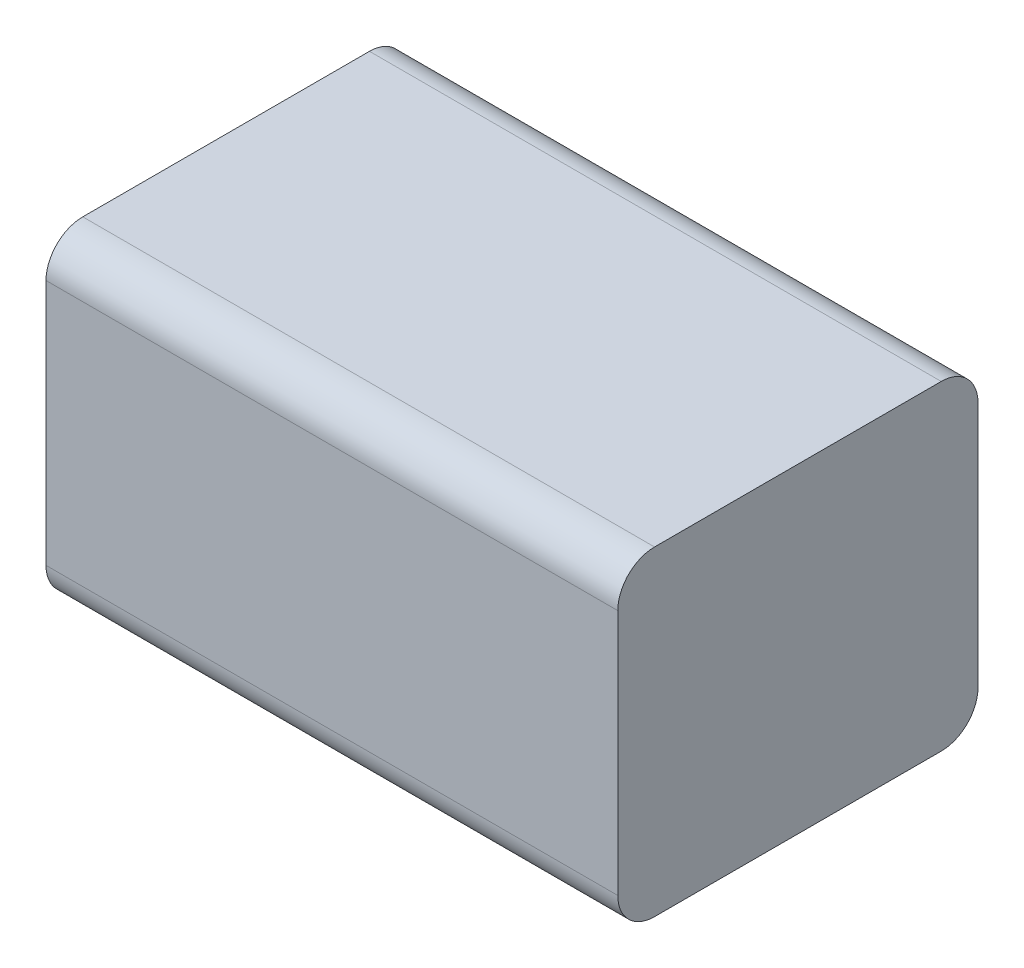
ISO-10303-21;
HEADER;
FILE_DESCRIPTION(('STEP AP214'),'2;1');
FILE_NAME('part.step','',(''),(''),'','','');
FILE_SCHEMA(('AUTOMOTIVE_DESIGN { 1 0 10303 214 1 1 1 1 }'));
ENDSEC;
DATA;
#1=APPLICATION_CONTEXT('core data for automotive mechanical design processes');
#2=APPLICATION_PROTOCOL_DEFINITION('international standard','automotive_design',2000,#1);
#3=PRODUCT_CONTEXT('',#1,'mechanical');
#4=PRODUCT('Part','Part','',(#3));
#5=PRODUCT_RELATED_PRODUCT_CATEGORY('part','',(#4));
#6=PRODUCT_DEFINITION_FORMATION('','',#4);
#7=PRODUCT_DEFINITION_CONTEXT('part definition',#1,'design');
#8=PRODUCT_DEFINITION('design','',#6,#7);
#9=PRODUCT_DEFINITION_SHAPE('','',#8);
#10=(LENGTH_UNIT() NAMED_UNIT(*) SI_UNIT(.MILLI.,.METRE.));
#11=(NAMED_UNIT(*) PLANE_ANGLE_UNIT() SI_UNIT($,.RADIAN.));
#12=(NAMED_UNIT(*) SI_UNIT($,.STERADIAN.) SOLID_ANGLE_UNIT());
#13=UNCERTAINTY_MEASURE_WITH_UNIT(LENGTH_MEASURE(1.E-05),#10,'distance_accuracy_value','');
#14=(GEOMETRIC_REPRESENTATION_CONTEXT(3) GLOBAL_UNCERTAINTY_ASSIGNED_CONTEXT((#13)) GLOBAL_UNIT_ASSIGNED_CONTEXT((#10,
#11,#12)) REPRESENTATION_CONTEXT('',''));
#15=CARTESIAN_POINT('',(0.,0.,0.));
#16=DIRECTION('',(0.,0.,1.));
#17=DIRECTION('',(1.,0.,0.));
#18=AXIS2_PLACEMENT_3D('',#15,#16,#17);
#19=CARTESIAN_POINT('',(-1.4,-0.784,0.018));
#20=DIRECTION('',(1.,0.,0.));
#21=DIRECTION('',(0.,0.,1.));
#22=AXIS2_PLACEMENT_3D('',#19,#20,#21);
#23=PLANE('',#22);
#24=CARTESIAN_POINT('',(-1.4,-0.604,1.602));
#25=DIRECTION('',(-1.,0.,0.));
#26=DIRECTION('',(0.,-1.,0.));
#27=AXIS2_PLACEMENT_3D('',#24,#25,#26);
#28=CIRCLE('',#27,0.18);
#29=CARTESIAN_POINT('',(-1.4,-0.784,1.602));
#30=VERTEX_POINT('',#29);
#31=CARTESIAN_POINT('',(-1.4,-0.604,1.782));
#32=VERTEX_POINT('',#31);
#33=EDGE_CURVE('E11',#30,#32,#28,.T.);
#34=ORIENTED_EDGE('',*,*,#33,.T.);
#35=DIRECTION('',(0.,1.,0.));
#36=VECTOR('',#35,1.);
#37=CARTESIAN_POINT('',(-1.4,-0.604,1.782));
#38=LINE('',#37,#36);
#39=CARTESIAN_POINT('',(-1.4,0.604,1.782));
#40=VERTEX_POINT('',#39);
#41=EDGE_CURVE('E142',#32,#40,#38,.T.);
#42=ORIENTED_EDGE('',*,*,#41,.T.);
#43=CARTESIAN_POINT('',(-1.4,0.604,1.602));
#44=DIRECTION('',(1.,0.,0.));
#45=DIRECTION('',(0.,1.,0.));
#46=AXIS2_PLACEMENT_3D('',#43,#44,#45);
#47=CIRCLE('',#46,0.18);
#48=CARTESIAN_POINT('',(-1.4,0.784,1.602));
#49=VERTEX_POINT('',#48);
#50=EDGE_CURVE('E136',#49,#40,#47,.T.);
#51=ORIENTED_EDGE('',*,*,#50,.F.);
#52=DIRECTION('',(0.,0.,1.));
#53=VECTOR('',#52,1.);
#54=CARTESIAN_POINT('',(-1.4,0.784,0.198));
#55=LINE('',#54,#53);
#56=CARTESIAN_POINT('',(-1.4,0.784,0.198));
#57=VERTEX_POINT('',#56);
#58=EDGE_CURVE('E97',#57,#49,#55,.T.);
#59=ORIENTED_EDGE('',*,*,#58,.F.);
#60=CARTESIAN_POINT('',(-1.4,0.604,0.198));
#61=DIRECTION('',(-1.,0.,0.));
#62=DIRECTION('',(0.,1.,0.));
#63=AXIS2_PLACEMENT_3D('',#60,#61,#62);
#64=CIRCLE('',#63,0.18);
#65=CARTESIAN_POINT('',(-1.4,0.604,0.018));
#66=VERTEX_POINT('',#65);
#67=EDGE_CURVE('E120',#57,#66,#64,.T.);
#68=ORIENTED_EDGE('',*,*,#67,.T.);
#69=DIRECTION('',(0.,1.,0.));
#70=VECTOR('',#69,1.);
#71=CARTESIAN_POINT('',(-1.4,-0.604,0.018));
#72=LINE('',#71,#70);
#73=CARTESIAN_POINT('',(-1.4,-0.604,0.018));
#74=VERTEX_POINT('',#73);
#75=EDGE_CURVE('E112',#74,#66,#72,.T.);
#76=ORIENTED_EDGE('',*,*,#75,.F.);
#77=CARTESIAN_POINT('',(-1.4,-0.604,0.198));
#78=DIRECTION('',(1.,0.,0.));
#79=DIRECTION('',(0.,-1.,0.));
#80=AXIS2_PLACEMENT_3D('',#77,#78,#79);
#81=CIRCLE('',#80,0.18);
#82=CARTESIAN_POINT('',(-1.4,-0.784,0.198));
#83=VERTEX_POINT('',#82);
#84=EDGE_CURVE('E140',#83,#74,#81,.T.);
#85=ORIENTED_EDGE('',*,*,#84,.F.);
#86=DIRECTION('',(0.,0.,1.));
#87=VECTOR('',#86,1.);
#88=CARTESIAN_POINT('',(-1.4,-0.784,0.198));
#89=LINE('',#88,#87);
#90=EDGE_CURVE('E138',#83,#30,#89,.T.);
#91=ORIENTED_EDGE('',*,*,#90,.T.);
#92=EDGE_LOOP('',(#34,#42,#51,#59,#68,#76,#85,#91));
#93=FACE_BOUND('',#92,.T.);
#94=ADVANCED_FACE('F17',(#93),#23,.F.);
#95=CARTESIAN_POINT('',(-1.4,-0.784,0.018));
#96=DIRECTION('',(0.,1.,0.));
#97=DIRECTION('',(0.,0.,1.));
#98=AXIS2_PLACEMENT_3D('',#95,#96,#97);
#99=PLANE('',#98);
#100=DIRECTION('',(1.,0.,0.));
#101=VECTOR('',#100,1.);
#102=CARTESIAN_POINT('',(-1.4,-0.784,1.602));
#103=LINE('',#102,#101);
#104=CARTESIAN_POINT('',(1.4,-0.784,1.602));
#105=VERTEX_POINT('',#104);
#106=EDGE_CURVE('E24',#30,#105,#103,.T.);
#107=ORIENTED_EDGE('',*,*,#106,.F.);
#108=ORIENTED_EDGE('',*,*,#90,.F.);
#109=DIRECTION('',(1.,0.,0.));
#110=VECTOR('',#109,1.);
#111=CARTESIAN_POINT('',(-1.4,-0.784,0.198));
#112=LINE('',#111,#110);
#113=CARTESIAN_POINT('',(1.4,-0.784,0.198));
#114=VERTEX_POINT('',#113);
#115=EDGE_CURVE('E132',#83,#114,#112,.T.);
#116=ORIENTED_EDGE('',*,*,#115,.T.);
#117=DIRECTION('',(0.,0.,1.));
#118=VECTOR('',#117,1.);
#119=CARTESIAN_POINT('',(1.4,-0.784,0.198));
#120=LINE('',#119,#118);
#121=EDGE_CURVE('E122',#114,#105,#120,.T.);
#122=ORIENTED_EDGE('',*,*,#121,.T.);
#123=EDGE_LOOP('',(#107,#108,#116,#122));
#124=FACE_BOUND('',#123,.T.);
#125=ADVANCED_FACE('F147',(#124),#99,.F.);
#126=CARTESIAN_POINT('',(-1.4,-0.604,0.198));
#127=DIRECTION('',(1.,0.,0.));
#128=DIRECTION('',(0.,-1.,0.));
#129=AXIS2_PLACEMENT_3D('',#126,#127,#128);
#130=CYLINDRICAL_SURFACE('',#129,0.18);
#131=ORIENTED_EDGE('',*,*,#84,.T.);
#132=DIRECTION('',(1.,0.,0.));
#133=VECTOR('',#132,1.);
#134=CARTESIAN_POINT('',(-1.4,-0.604,0.018));
#135=LINE('',#134,#133);
#136=CARTESIAN_POINT('',(1.4,-0.604,0.018));
#137=VERTEX_POINT('',#136);
#138=EDGE_CURVE('E134',#74,#137,#135,.T.);
#139=ORIENTED_EDGE('',*,*,#138,.T.);
#140=CARTESIAN_POINT('',(1.4,-0.604,0.198));
#141=DIRECTION('',(1.,0.,0.));
#142=DIRECTION('',(0.,-1.,0.));
#143=AXIS2_PLACEMENT_3D('',#140,#141,#142);
#144=CIRCLE('',#143,0.18);
#145=EDGE_CURVE('E124',#114,#137,#144,.T.);
#146=ORIENTED_EDGE('',*,*,#145,.F.);
#147=ORIENTED_EDGE('',*,*,#115,.F.);
#148=EDGE_LOOP('',(#131,#139,#146,#147));
#149=FACE_BOUND('',#148,.T.);
#150=ADVANCED_FACE('F163',(#149),#130,.T.);
#151=CARTESIAN_POINT('',(-1.4,-0.604,1.602));
#152=DIRECTION('',(1.,0.,0.));
#153=DIRECTION('',(0.,-1.,0.));
#154=AXIS2_PLACEMENT_3D('',#151,#152,#153);
#155=CYLINDRICAL_SURFACE('',#154,0.18);
#156=ORIENTED_EDGE('',*,*,#106,.T.);
#157=CARTESIAN_POINT('',(1.4,-0.604,1.602));
#158=DIRECTION('',(-1.,0.,0.));
#159=DIRECTION('',(0.,-1.,0.));
#160=AXIS2_PLACEMENT_3D('',#157,#158,#159);
#161=CIRCLE('',#160,0.18);
#162=CARTESIAN_POINT('',(1.4,-0.604,1.782));
#163=VERTEX_POINT('',#162);
#164=EDGE_CURVE('E127',#105,#163,#161,.T.);
#165=ORIENTED_EDGE('',*,*,#164,.T.);
#166=DIRECTION('',(1.,0.,0.));
#167=VECTOR('',#166,1.);
#168=CARTESIAN_POINT('',(-1.4,-0.604,1.782));
#169=LINE('',#168,#167);
#170=EDGE_CURVE('E115',#32,#163,#169,.T.);
#171=ORIENTED_EDGE('',*,*,#170,.F.);
#172=ORIENTED_EDGE('',*,*,#33,.F.);
#173=EDGE_LOOP('',(#156,#165,#171,#172));
#174=FACE_BOUND('',#173,.T.);
#175=ADVANCED_FACE('F144',(#174),#155,.T.);
#176=CARTESIAN_POINT('',(-1.4,-0.784,0.018));
#177=DIRECTION('',(0.,0.,1.));
#178=DIRECTION('',(1.,0.,0.));
#179=AXIS2_PLACEMENT_3D('',#176,#177,#178);
#180=PLANE('',#179);
#181=DIRECTION('',(1.,0.,0.));
#182=VECTOR('',#181,1.);
#183=CARTESIAN_POINT('',(-1.4,0.604,0.018));
#184=LINE('',#183,#182);
#185=CARTESIAN_POINT('',(1.4,0.604,0.018));
#186=VERTEX_POINT('',#185);
#187=EDGE_CURVE('E129',#66,#186,#184,.T.);
#188=ORIENTED_EDGE('',*,*,#187,.T.);
#189=DIRECTION('',(0.,1.,0.));
#190=VECTOR('',#189,1.);
#191=CARTESIAN_POINT('',(1.4,-0.604,0.018));
#192=LINE('',#191,#190);
#193=EDGE_CURVE('E118',#137,#186,#192,.T.);
#194=ORIENTED_EDGE('',*,*,#193,.F.);
#195=ORIENTED_EDGE('',*,*,#138,.F.);
#196=ORIENTED_EDGE('',*,*,#75,.T.);
#197=EDGE_LOOP('',(#188,#194,#195,#196));
#198=FACE_BOUND('',#197,.T.);
#199=ADVANCED_FACE('F159',(#198),#180,.F.);
#200=CARTESIAN_POINT('',(-1.4,-0.784,1.782));
#201=DIRECTION('',(0.,0.,1.));
#202=DIRECTION('',(1.,0.,0.));
#203=AXIS2_PLACEMENT_3D('',#200,#201,#202);
#204=PLANE('',#203);
#205=ORIENTED_EDGE('',*,*,#41,.F.);
#206=ORIENTED_EDGE('',*,*,#170,.T.);
#207=DIRECTION('',(0.,1.,0.));
#208=VECTOR('',#207,1.);
#209=CARTESIAN_POINT('',(1.4,-0.604,1.782));
#210=LINE('',#209,#208);
#211=CARTESIAN_POINT('',(1.4,0.604,1.782));
#212=VERTEX_POINT('',#211);
#213=EDGE_CURVE('E104',#163,#212,#210,.T.);
#214=ORIENTED_EDGE('',*,*,#213,.T.);
#215=DIRECTION('',(1.,0.,0.));
#216=VECTOR('',#215,1.);
#217=CARTESIAN_POINT('',(-1.4,0.604,1.782));
#218=LINE('',#217,#216);
#219=EDGE_CURVE('E85',#40,#212,#218,.T.);
#220=ORIENTED_EDGE('',*,*,#219,.F.);
#221=EDGE_LOOP('',(#205,#206,#214,#220));
#222=FACE_BOUND('',#221,.T.);
#223=ADVANCED_FACE('F151',(#222),#204,.T.);
#224=CARTESIAN_POINT('',(-1.4,0.604,0.198));
#225=DIRECTION('',(1.,0.,0.));
#226=DIRECTION('',(0.,1.,0.));
#227=AXIS2_PLACEMENT_3D('',#224,#225,#226);
#228=CYLINDRICAL_SURFACE('',#227,0.18);
#229=DIRECTION('',(1.,0.,0.));
#230=VECTOR('',#229,1.);
#231=CARTESIAN_POINT('',(-1.4,0.784,0.198));
#232=LINE('',#231,#230);
#233=CARTESIAN_POINT('',(1.4,0.784,0.198));
#234=VERTEX_POINT('',#233);
#235=EDGE_CURVE('E110',#57,#234,#232,.T.);
#236=ORIENTED_EDGE('',*,*,#235,.T.);
#237=CARTESIAN_POINT('',(1.4,0.604,0.198));
#238=DIRECTION('',(-1.,0.,0.));
#239=DIRECTION('',(0.,1.,0.));
#240=AXIS2_PLACEMENT_3D('',#237,#238,#239);
#241=CIRCLE('',#240,0.18);
#242=EDGE_CURVE('E103',#234,#186,#241,.T.);
#243=ORIENTED_EDGE('',*,*,#242,.T.);
#244=ORIENTED_EDGE('',*,*,#187,.F.);
#245=ORIENTED_EDGE('',*,*,#67,.F.);
#246=EDGE_LOOP('',(#236,#243,#244,#245));
#247=FACE_BOUND('',#246,.T.);
#248=ADVANCED_FACE('F156',(#247),#228,.T.);
#249=CARTESIAN_POINT('',(-1.4,0.604,1.602));
#250=DIRECTION('',(1.,0.,0.));
#251=DIRECTION('',(0.,1.,0.));
#252=AXIS2_PLACEMENT_3D('',#249,#250,#251);
#253=CYLINDRICAL_SURFACE('',#252,0.18);
#254=ORIENTED_EDGE('',*,*,#50,.T.);
#255=ORIENTED_EDGE('',*,*,#219,.T.);
#256=CARTESIAN_POINT('',(1.4,0.604,1.602));
#257=DIRECTION('',(1.,0.,0.));
#258=DIRECTION('',(0.,1.,0.));
#259=AXIS2_PLACEMENT_3D('',#256,#257,#258);
#260=CIRCLE('',#259,0.18);
#261=CARTESIAN_POINT('',(1.4,0.784,1.602));
#262=VERTEX_POINT('',#261);
#263=EDGE_CURVE('E79',#262,#212,#260,.T.);
#264=ORIENTED_EDGE('',*,*,#263,.F.);
#265=DIRECTION('',(1.,0.,0.));
#266=VECTOR('',#265,1.);
#267=CARTESIAN_POINT('',(-1.4,0.784,1.602));
#268=LINE('',#267,#266);
#269=EDGE_CURVE('E83',#49,#262,#268,.T.);
#270=ORIENTED_EDGE('',*,*,#269,.F.);
#271=EDGE_LOOP('',(#254,#255,#264,#270));
#272=FACE_BOUND('',#271,.T.);
#273=ADVANCED_FACE('F82',(#272),#253,.T.);
#274=CARTESIAN_POINT('',(-1.4,0.784,0.018));
#275=DIRECTION('',(0.,1.,0.));
#276=DIRECTION('',(0.,0.,1.));
#277=AXIS2_PLACEMENT_3D('',#274,#275,#276);
#278=PLANE('',#277);
#279=DIRECTION('',(0.,0.,1.));
#280=VECTOR('',#279,1.);
#281=CARTESIAN_POINT('',(1.4,0.784,0.198));
#282=LINE('',#281,#280);
#283=EDGE_CURVE('E95',#234,#262,#282,.T.);
#284=ORIENTED_EDGE('',*,*,#283,.F.);
#285=ORIENTED_EDGE('',*,*,#235,.F.);
#286=ORIENTED_EDGE('',*,*,#58,.T.);
#287=ORIENTED_EDGE('',*,*,#269,.T.);
#288=EDGE_LOOP('',(#284,#285,#286,#287));
#289=FACE_BOUND('',#288,.T.);
#290=ADVANCED_FACE('F93',(#289),#278,.T.);
#291=CARTESIAN_POINT('',(1.4,-0.784,0.018));
#292=DIRECTION('',(1.,0.,0.));
#293=DIRECTION('',(0.,0.,1.));
#294=AXIS2_PLACEMENT_3D('',#291,#292,#293);
#295=PLANE('',#294);
#296=ORIENTED_EDGE('',*,*,#121,.F.);
#297=ORIENTED_EDGE('',*,*,#145,.T.);
#298=ORIENTED_EDGE('',*,*,#193,.T.);
#299=ORIENTED_EDGE('',*,*,#242,.F.);
#300=ORIENTED_EDGE('',*,*,#283,.T.);
#301=ORIENTED_EDGE('',*,*,#263,.T.);
#302=ORIENTED_EDGE('',*,*,#213,.F.);
#303=ORIENTED_EDGE('',*,*,#164,.F.);
#304=EDGE_LOOP('',(#296,#297,#298,#299,#300,#301,#302,#303));
#305=FACE_BOUND('',#304,.T.);
#306=ADVANCED_FACE('F100',(#305),#295,.T.);
#307=CLOSED_SHELL('',(#94,#125,#150,#175,#199,#223,#248,#273,#290,#306));
#308=MANIFOLD_SOLID_BREP('B1',#307);
#309=ADVANCED_BREP_SHAPE_REPRESENTATION('',(#18,#308),#14);
#310=SHAPE_DEFINITION_REPRESENTATION(#9,#309);
ENDSEC;
END-ISO-10303-21;
